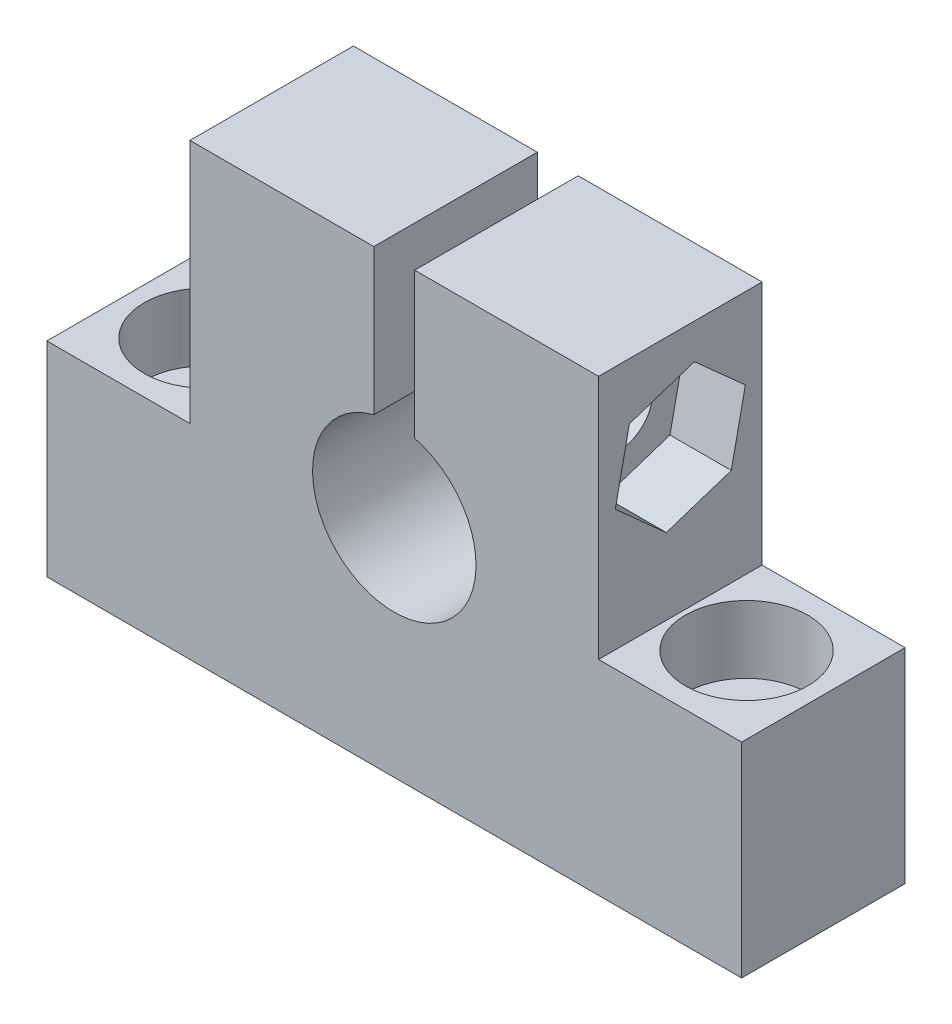
ISO-10303-21;
HEADER;
FILE_DESCRIPTION(('STEP AP214'),'2;1');
FILE_NAME('part.step','',(''),(''),'','','');
FILE_SCHEMA(('AUTOMOTIVE_DESIGN { 1 0 10303 214 1 1 1 1 }'));
ENDSEC;
DATA;
#1=APPLICATION_CONTEXT('core data for automotive mechanical design processes');
#2=APPLICATION_PROTOCOL_DEFINITION('international standard','automotive_design',2000,#1);
#3=PRODUCT_CONTEXT('',#1,'mechanical');
#4=PRODUCT('Part','Part','',(#3));
#5=PRODUCT_RELATED_PRODUCT_CATEGORY('part','',(#4));
#6=PRODUCT_DEFINITION_FORMATION('','',#4);
#7=PRODUCT_DEFINITION_CONTEXT('part definition',#1,'design');
#8=PRODUCT_DEFINITION('design','',#6,#7);
#9=PRODUCT_DEFINITION_SHAPE('','',#8);
#10=(LENGTH_UNIT() NAMED_UNIT(*) SI_UNIT(.MILLI.,.METRE.));
#11=(NAMED_UNIT(*) PLANE_ANGLE_UNIT() SI_UNIT($,.RADIAN.));
#12=(NAMED_UNIT(*) SI_UNIT($,.STERADIAN.) SOLID_ANGLE_UNIT());
#13=UNCERTAINTY_MEASURE_WITH_UNIT(LENGTH_MEASURE(1.E-05),#10,'distance_accuracy_value','');
#14=(GEOMETRIC_REPRESENTATION_CONTEXT(3) GLOBAL_UNCERTAINTY_ASSIGNED_CONTEXT((#13)) GLOBAL_UNIT_ASSIGNED_CONTEXT((#10,
#11,#12)) REPRESENTATION_CONTEXT('',''));
#15=CARTESIAN_POINT('',(0.,0.,0.));
#16=DIRECTION('',(0.,0.,1.));
#17=DIRECTION('',(1.,0.,0.));
#18=AXIS2_PLACEMENT_3D('',#15,#16,#17);
#19=CARTESIAN_POINT('',(13.2396132723695,0.,4.));
#20=DIRECTION('',(0.,1.,0.));
#21=DIRECTION('',(-1.,0.,0.));
#22=AXIS2_PLACEMENT_3D('',#19,#20,#21);
#23=CYLINDRICAL_SURFACE('',#22,1.65);
#24=CARTESIAN_POINT('',(13.2396132723695,0.,4.));
#25=DIRECTION('',(0.,1.,0.));
#26=DIRECTION('',(1.,0.,0.));
#27=AXIS2_PLACEMENT_3D('',#24,#25,#26);
#28=CIRCLE('',#27,1.65);
#29=CARTESIAN_POINT('',(14.8896132723695,0.,4.));
#30=VERTEX_POINT('',#29);
#31=EDGE_CURVE('E189',#30,#30,#28,.T.);
#32=ORIENTED_EDGE('',*,*,#31,.F.);
#33=EDGE_LOOP('',(#32));
#34=FACE_BOUND('',#33,.T.);
#35=CARTESIAN_POINT('',(13.2396132723695,6.69999999999999,4.));
#36=DIRECTION('',(0.,1.,0.));
#37=DIRECTION('',(-1.,0.,0.));
#38=AXIS2_PLACEMENT_3D('',#35,#36,#37);
#39=CIRCLE('',#38,1.65);
#40=CARTESIAN_POINT('',(11.5896132723695,6.69999999999999,4.));
#41=VERTEX_POINT('',#40);
#42=EDGE_CURVE('E38',#41,#41,#39,.F.);
#43=ORIENTED_EDGE('',*,*,#42,.F.);
#44=EDGE_LOOP('',(#43));
#45=FACE_BOUND('',#44,.T.);
#46=ADVANCED_FACE('F34',(#34,#45),#23,.F.);
#47=CARTESIAN_POINT('',(-13.2396132723695,0.,4.));
#48=DIRECTION('',(0.,1.,0.));
#49=DIRECTION('',(-1.,0.,0.));
#50=AXIS2_PLACEMENT_3D('',#47,#48,#49);
#51=CYLINDRICAL_SURFACE('',#50,1.65);
#52=CARTESIAN_POINT('',(-13.2396132723695,0.,4.));
#53=DIRECTION('',(0.,1.,0.));
#54=DIRECTION('',(-1.,0.,0.));
#55=AXIS2_PLACEMENT_3D('',#52,#53,#54);
#56=CIRCLE('',#55,1.65);
#57=CARTESIAN_POINT('',(-14.8896132723695,0.,4.));
#58=VERTEX_POINT('',#57);
#59=EDGE_CURVE('E201',#58,#58,#56,.T.);
#60=ORIENTED_EDGE('',*,*,#59,.F.);
#61=EDGE_LOOP('',(#60));
#62=FACE_BOUND('',#61,.T.);
#63=CARTESIAN_POINT('',(-13.2396132723695,6.7,4.));
#64=DIRECTION('',(0.,1.,0.));
#65=DIRECTION('',(-1.,0.,0.));
#66=AXIS2_PLACEMENT_3D('',#63,#64,#65);
#67=CIRCLE('',#66,1.65);
#68=CARTESIAN_POINT('',(-14.8896132723695,6.7,4.));
#69=VERTEX_POINT('',#68);
#70=EDGE_CURVE('E319',#69,#69,#67,.F.);
#71=ORIENTED_EDGE('',*,*,#70,.F.);
#72=EDGE_LOOP('',(#71));
#73=FACE_BOUND('',#72,.T.);
#74=ADVANCED_FACE('F349',(#62,#73),#51,.F.);
#75=CARTESIAN_POINT('',(17.,17.,4.));
#76=DIRECTION('',(-1.,0.,0.));
#77=DIRECTION('',(0.,-1.,0.));
#78=AXIS2_PLACEMENT_3D('',#75,#76,#77);
#79=CYLINDRICAL_SURFACE('',#78,1.65);
#80=CARTESIAN_POINT('',(1.,17.,4.));
#81=DIRECTION('',(1.,0.,0.));
#82=DIRECTION('',(0.,1.,0.));
#83=AXIS2_PLACEMENT_3D('',#80,#81,#82);
#84=CIRCLE('',#83,1.65);
#85=CARTESIAN_POINT('',(1.,18.65,4.));
#86=VERTEX_POINT('',#85);
#87=EDGE_CURVE('E228',#86,#86,#84,.T.);
#88=ORIENTED_EDGE('',*,*,#87,.F.);
#89=EDGE_LOOP('',(#88));
#90=FACE_BOUND('',#89,.T.);
#91=CARTESIAN_POINT('',(7.,17.,4.));
#92=DIRECTION('',(1.,0.,0.));
#93=DIRECTION('',(0.,1.,0.));
#94=AXIS2_PLACEMENT_3D('',#91,#92,#93);
#95=CIRCLE('',#94,1.65);
#96=CARTESIAN_POINT('',(7.,18.65,4.));
#97=VERTEX_POINT('',#96);
#98=EDGE_CURVE('E213',#97,#97,#95,.F.);
#99=ORIENTED_EDGE('',*,*,#98,.F.);
#100=EDGE_LOOP('',(#99));
#101=FACE_BOUND('',#100,.T.);
#102=ADVANCED_FACE('F372',(#90,#101),#79,.F.);
#103=CARTESIAN_POINT('',(-1.,17.,4.));
#104=DIRECTION('',(-1.,0.,0.));
#105=DIRECTION('',(0.,-1.,0.));
#106=AXIS2_PLACEMENT_3D('',#103,#104,#105);
#107=CIRCLE('',#106,1.65);
#108=CARTESIAN_POINT('',(-1.,15.35,4.));
#109=VERTEX_POINT('',#108);
#110=EDGE_CURVE('E232',#109,#109,#107,.T.);
#111=ORIENTED_EDGE('',*,*,#110,.F.);
#112=EDGE_LOOP('',(#111));
#113=FACE_BOUND('',#112,.T.);
#114=CARTESIAN_POINT('',(-6.7,17.,4.));
#115=DIRECTION('',(-1.,0.,0.));
#116=DIRECTION('',(0.,-1.,0.));
#117=AXIS2_PLACEMENT_3D('',#114,#115,#116);
#118=CIRCLE('',#117,1.65);
#119=CARTESIAN_POINT('',(-6.7,15.35,4.));
#120=VERTEX_POINT('',#119);
#121=EDGE_CURVE('E224',#120,#120,#118,.F.);
#122=ORIENTED_EDGE('',*,*,#121,.F.);
#123=EDGE_LOOP('',(#122));
#124=FACE_BOUND('',#123,.T.);
#125=ADVANCED_FACE('F408',(#113,#124),#79,.F.);
#126=CARTESIAN_POINT('',(-10.,22.,8.));
#127=DIRECTION('',(0.,-1.,0.));
#128=DIRECTION('',(0.,0.,-1.));
#129=AXIS2_PLACEMENT_3D('',#126,#127,#128);
#130=PLANE('',#129);
#131=DIRECTION('',(-1.,0.,0.));
#132=VECTOR('',#131,1.);
#133=CARTESIAN_POINT('',(-10.,22.,0.));
#134=LINE('',#133,#132);
#135=CARTESIAN_POINT('',(10.,22.,0.));
#136=VERTEX_POINT('',#135);
#137=CARTESIAN_POINT('',(1.,22.,0.));
#138=VERTEX_POINT('',#137);
#139=EDGE_CURVE('E281',#136,#138,#134,.T.);
#140=ORIENTED_EDGE('',*,*,#139,.T.);
#141=DIRECTION('',(0.,0.,1.));
#142=VECTOR('',#141,1.);
#143=CARTESIAN_POINT('',(1.,22.,0.));
#144=LINE('',#143,#142);
#145=CARTESIAN_POINT('',(1.,22.,8.));
#146=VERTEX_POINT('',#145);
#147=EDGE_CURVE('E241',#138,#146,#144,.T.);
#148=ORIENTED_EDGE('',*,*,#147,.T.);
#149=DIRECTION('',(-1.,0.,0.));
#150=VECTOR('',#149,1.);
#151=CARTESIAN_POINT('',(-10.,22.,8.));
#152=LINE('',#151,#150);
#153=CARTESIAN_POINT('',(10.,22.,8.));
#154=VERTEX_POINT('',#153);
#155=EDGE_CURVE('E262',#154,#146,#152,.T.);
#156=ORIENTED_EDGE('',*,*,#155,.F.);
#157=DIRECTION('',(0.,0.,-1.));
#158=VECTOR('',#157,1.);
#159=CARTESIAN_POINT('',(10.,22.,8.));
#160=LINE('',#159,#158);
#161=EDGE_CURVE('E11',#154,#136,#160,.T.);
#162=ORIENTED_EDGE('',*,*,#161,.T.);
#163=EDGE_LOOP('',(#140,#148,#156,#162));
#164=FACE_BOUND('',#163,.T.);
#165=ADVANCED_FACE('F452',(#164),#130,.F.);
#166=CARTESIAN_POINT('',(10.,22.,8.));
#167=DIRECTION('',(-1.,0.,0.));
#168=DIRECTION('',(0.,-1.,0.));
#169=AXIS2_PLACEMENT_3D('',#166,#167,#168);
#170=PLANE('',#169);
#171=DIRECTION('',(0.,-0.978664212669979,0.205466198775006));
#172=VECTOR('',#171,1.);
#173=CARTESIAN_POINT('',(10.,19.2344449116782,6.4941109177438));
#174=LINE('',#173,#172);
#175=CARTESIAN_POINT('',(10.,19.2344449116782,6.4941109177438));
#176=VERTEX_POINT('',#175);
#177=CARTESIAN_POINT('',(10.,15.9572590412169,7.18214151574208));
#178=VERTEX_POINT('',#177);
#179=EDGE_CURVE('E200',#176,#178,#174,.T.);
#180=ORIENTED_EDGE('',*,*,#179,.F.);
#181=DIRECTION('',(0.,-0.31139315857681,0.950281169334401));
#182=VECTOR('',#181,1.);
#183=CARTESIAN_POINT('',(10.,20.2771858704613,3.31196940200171));
#184=LINE('',#183,#182);
#185=CARTESIAN_POINT('',(10.,20.2771858704613,3.31196940200171));
#186=VERTEX_POINT('',#185);
#187=EDGE_CURVE('E51',#186,#176,#184,.T.);
#188=ORIENTED_EDGE('',*,*,#187,.F.);
#189=DIRECTION('',(0.,0.667271054093169,0.744814970559394));
#190=VECTOR('',#189,1.);
#191=CARTESIAN_POINT('',(10.,18.0427409587831,0.817858484257921));
#192=LINE('',#191,#190);
#193=CARTESIAN_POINT('',(10.,18.0427409587831,0.817858484257921));
#194=VERTEX_POINT('',#193);
#195=EDGE_CURVE('E183',#194,#186,#192,.T.);
#196=ORIENTED_EDGE('',*,*,#195,.F.);
#197=DIRECTION('',(0.,0.978664212669978,-0.205466198775008));
#198=VECTOR('',#197,1.);
#199=CARTESIAN_POINT('',(10.,14.7655550883218,1.50588908225622));
#200=LINE('',#199,#198);
#201=CARTESIAN_POINT('',(10.,14.7655550883218,1.50588908225622));
#202=VERTEX_POINT('',#201);
#203=EDGE_CURVE('E186',#202,#194,#200,.T.);
#204=ORIENTED_EDGE('',*,*,#203,.F.);
#205=DIRECTION('',(0.,0.31139315857681,-0.950281169334401));
#206=VECTOR('',#205,1.);
#207=CARTESIAN_POINT('',(10.,13.7228141295387,4.68803059799829));
#208=LINE('',#207,#206);
#209=CARTESIAN_POINT('',(10.,13.7228141295387,4.68803059799829));
#210=VERTEX_POINT('',#209);
#211=EDGE_CURVE('E206',#210,#202,#208,.T.);
#212=ORIENTED_EDGE('',*,*,#211,.F.);
#213=DIRECTION('',(0.,-0.667271054093169,-0.744814970559394));
#214=VECTOR('',#213,1.);
#215=CARTESIAN_POINT('',(10.,15.9572590412169,7.18214151574208));
#216=LINE('',#215,#214);
#217=EDGE_CURVE('E203',#178,#210,#216,.T.);
#218=ORIENTED_EDGE('',*,*,#217,.F.);
#219=EDGE_LOOP('',(#180,#188,#196,#204,#212,#218));
#220=FACE_BOUND('',#219,.T.);
#221=DIRECTION('',(0.,1.,0.));
#222=VECTOR('',#221,1.);
#223=CARTESIAN_POINT('',(10.,22.,0.));
#224=LINE('',#223,#222);
#225=CARTESIAN_POINT('',(10.,10.,0.));
#226=VERTEX_POINT('',#225);
#227=EDGE_CURVE('E250',#226,#136,#224,.T.);
#228=ORIENTED_EDGE('',*,*,#227,.T.);
#229=ORIENTED_EDGE('',*,*,#161,.F.);
#230=DIRECTION('',(0.,1.,0.));
#231=VECTOR('',#230,1.);
#232=CARTESIAN_POINT('',(10.,22.,8.));
#233=LINE('',#232,#231);
#234=CARTESIAN_POINT('',(10.,10.,8.));
#235=VERTEX_POINT('',#234);
#236=EDGE_CURVE('E257',#235,#154,#233,.T.);
#237=ORIENTED_EDGE('',*,*,#236,.F.);
#238=DIRECTION('',(0.,0.,-1.));
#239=VECTOR('',#238,1.);
#240=CARTESIAN_POINT('',(10.,10.,8.));
#241=LINE('',#240,#239);
#242=EDGE_CURVE('E277',#235,#226,#241,.T.);
#243=ORIENTED_EDGE('',*,*,#242,.T.);
#244=EDGE_LOOP('',(#228,#229,#237,#243));
#245=FACE_BOUND('',#244,.T.);
#246=ADVANCED_FACE('F36',(#220,#245),#170,.F.);
#247=CARTESIAN_POINT('',(-1.,22.,8.));
#248=VERTEX_POINT('',#247);
#249=CARTESIAN_POINT('',(-10.,22.,8.));
#250=VERTEX_POINT('',#249);
#251=EDGE_CURVE('E260',#248,#250,#152,.T.);
#252=ORIENTED_EDGE('',*,*,#251,.F.);
#253=DIRECTION('',(0.,0.,1.));
#254=VECTOR('',#253,1.);
#255=CARTESIAN_POINT('',(-1.,22.,0.));
#256=LINE('',#255,#254);
#257=CARTESIAN_POINT('',(-1.,22.,0.));
#258=VERTEX_POINT('',#257);
#259=EDGE_CURVE('E253',#258,#248,#256,.T.);
#260=ORIENTED_EDGE('',*,*,#259,.F.);
#261=CARTESIAN_POINT('',(-10.,22.,0.));
#262=VERTEX_POINT('',#261);
#263=EDGE_CURVE('E280',#258,#262,#134,.T.);
#264=ORIENTED_EDGE('',*,*,#263,.T.);
#265=DIRECTION('',(0.,0.,-1.));
#266=VECTOR('',#265,1.);
#267=CARTESIAN_POINT('',(-10.,22.,8.));
#268=LINE('',#267,#266);
#269=EDGE_CURVE('E43',#250,#262,#268,.T.);
#270=ORIENTED_EDGE('',*,*,#269,.F.);
#271=EDGE_LOOP('',(#252,#260,#264,#270));
#272=FACE_BOUND('',#271,.T.);
#273=ADVANCED_FACE('F448',(#272),#130,.F.);
#274=CARTESIAN_POINT('',(-10.,22.,8.));
#275=DIRECTION('',(1.,0.,0.));
#276=DIRECTION('',(0.,1.,0.));
#277=AXIS2_PLACEMENT_3D('',#274,#275,#276);
#278=PLANE('',#277);
#279=CARTESIAN_POINT('',(-10.,17.,4.));
#280=DIRECTION('',(-1.,0.,0.));
#281=DIRECTION('',(0.,-1.,0.));
#282=AXIS2_PLACEMENT_3D('',#279,#280,#281);
#283=CIRCLE('',#282,3.);
#284=CARTESIAN_POINT('',(-10.,14.,4.));
#285=VERTEX_POINT('',#284);
#286=EDGE_CURVE('E225',#285,#285,#283,.T.);
#287=ORIENTED_EDGE('',*,*,#286,.F.);
#288=EDGE_LOOP('',(#287));
#289=FACE_BOUND('',#288,.T.);
#290=DIRECTION('',(0.,-1.,0.));
#291=VECTOR('',#290,1.);
#292=CARTESIAN_POINT('',(-10.,22.,0.));
#293=LINE('',#292,#291);
#294=CARTESIAN_POINT('',(-10.,10.,0.));
#295=VERTEX_POINT('',#294);
#296=EDGE_CURVE('E284',#262,#295,#293,.T.);
#297=ORIENTED_EDGE('',*,*,#296,.T.);
#298=DIRECTION('',(0.,0.,-1.));
#299=VECTOR('',#298,1.);
#300=CARTESIAN_POINT('',(-10.,10.,8.));
#301=LINE('',#300,#299);
#302=CARTESIAN_POINT('',(-10.,10.,8.));
#303=VERTEX_POINT('',#302);
#304=EDGE_CURVE('E309',#303,#295,#301,.T.);
#305=ORIENTED_EDGE('',*,*,#304,.F.);
#306=DIRECTION('',(0.,-1.,0.));
#307=VECTOR('',#306,1.);
#308=CARTESIAN_POINT('',(-10.,22.,8.));
#309=LINE('',#308,#307);
#310=EDGE_CURVE('E265',#250,#303,#309,.T.);
#311=ORIENTED_EDGE('',*,*,#310,.F.);
#312=ORIENTED_EDGE('',*,*,#269,.T.);
#313=EDGE_LOOP('',(#297,#305,#311,#312));
#314=FACE_BOUND('',#313,.T.);
#315=ADVANCED_FACE('F445',(#289,#314),#278,.F.);
#316=CARTESIAN_POINT('',(-10.,10.,8.));
#317=DIRECTION('',(0.,-1.,0.));
#318=DIRECTION('',(1.,0.,0.));
#319=AXIS2_PLACEMENT_3D('',#316,#317,#318);
#320=PLANE('',#319);
#321=CARTESIAN_POINT('',(-13.2396132723695,10.,4.));
#322=DIRECTION('',(0.,1.,0.));
#323=DIRECTION('',(-1.,0.,0.));
#324=AXIS2_PLACEMENT_3D('',#321,#322,#323);
#325=CIRCLE('',#324,3.);
#326=CARTESIAN_POINT('',(-16.2396132723695,10.,4.));
#327=VERTEX_POINT('',#326);
#328=EDGE_CURVE('E336',#327,#327,#325,.T.);
#329=ORIENTED_EDGE('',*,*,#328,.F.);
#330=EDGE_LOOP('',(#329));
#331=FACE_BOUND('',#330,.T.);
#332=DIRECTION('',(-1.,0.,0.));
#333=VECTOR('',#332,1.);
#334=CARTESIAN_POINT('',(-10.,10.,0.));
#335=LINE('',#334,#333);
#336=CARTESIAN_POINT('',(-17.,9.99999999999999,0.));
#337=VERTEX_POINT('',#336);
#338=EDGE_CURVE('E286',#295,#337,#335,.T.);
#339=ORIENTED_EDGE('',*,*,#338,.T.);
#340=DIRECTION('',(0.,0.,-1.));
#341=VECTOR('',#340,1.);
#342=CARTESIAN_POINT('',(-17.,9.99999999999999,8.));
#343=LINE('',#342,#341);
#344=CARTESIAN_POINT('',(-17.,9.99999999999999,8.));
#345=VERTEX_POINT('',#344);
#346=EDGE_CURVE('E306',#345,#337,#343,.T.);
#347=ORIENTED_EDGE('',*,*,#346,.F.);
#348=DIRECTION('',(-1.,0.,0.));
#349=VECTOR('',#348,1.);
#350=CARTESIAN_POINT('',(-10.,10.,8.));
#351=LINE('',#350,#349);
#352=EDGE_CURVE('E267',#303,#345,#351,.T.);
#353=ORIENTED_EDGE('',*,*,#352,.F.);
#354=ORIENTED_EDGE('',*,*,#304,.T.);
#355=EDGE_LOOP('',(#339,#347,#353,#354));
#356=FACE_BOUND('',#355,.T.);
#357=ADVANCED_FACE('F441',(#331,#356),#320,.F.);
#358=CARTESIAN_POINT('',(-17.,9.99999999999999,8.));
#359=DIRECTION('',(1.,0.,0.));
#360=DIRECTION('',(0.,0.,-1.));
#361=AXIS2_PLACEMENT_3D('',#358,#359,#360);
#362=PLANE('',#361);
#363=DIRECTION('',(0.,-1.,0.));
#364=VECTOR('',#363,1.);
#365=CARTESIAN_POINT('',(-17.,9.99999999999999,0.));
#366=LINE('',#365,#364);
#367=CARTESIAN_POINT('',(-17.,0.,0.));
#368=VERTEX_POINT('',#367);
#369=EDGE_CURVE('E288',#337,#368,#366,.T.);
#370=ORIENTED_EDGE('',*,*,#369,.T.);
#371=DIRECTION('',(0.,0.,-1.));
#372=VECTOR('',#371,1.);
#373=CARTESIAN_POINT('',(-17.,0.,8.));
#374=LINE('',#373,#372);
#375=CARTESIAN_POINT('',(-17.,0.,8.));
#376=VERTEX_POINT('',#375);
#377=EDGE_CURVE('E303',#376,#368,#374,.T.);
#378=ORIENTED_EDGE('',*,*,#377,.F.);
#379=DIRECTION('',(0.,-1.,0.));
#380=VECTOR('',#379,1.);
#381=CARTESIAN_POINT('',(-17.,9.99999999999999,8.));
#382=LINE('',#381,#380);
#383=EDGE_CURVE('E269',#345,#376,#382,.T.);
#384=ORIENTED_EDGE('',*,*,#383,.F.);
#385=ORIENTED_EDGE('',*,*,#346,.T.);
#386=EDGE_LOOP('',(#370,#378,#384,#385));
#387=FACE_BOUND('',#386,.T.);
#388=ADVANCED_FACE('F438',(#387),#362,.F.);
#389=CARTESIAN_POINT('',(17.,0.,8.));
#390=DIRECTION('',(0.,1.,0.));
#391=DIRECTION('',(0.,0.,1.));
#392=AXIS2_PLACEMENT_3D('',#389,#390,#391);
#393=PLANE('',#392);
#394=ORIENTED_EDGE('',*,*,#59,.T.);
#395=EDGE_LOOP('',(#394));
#396=FACE_BOUND('',#395,.T.);
#397=ORIENTED_EDGE('',*,*,#31,.T.);
#398=EDGE_LOOP('',(#397));
#399=FACE_BOUND('',#398,.T.);
#400=DIRECTION('',(1.,0.,0.));
#401=VECTOR('',#400,1.);
#402=CARTESIAN_POINT('',(17.,0.,0.));
#403=LINE('',#402,#401);
#404=CARTESIAN_POINT('',(17.,0.,0.));
#405=VERTEX_POINT('',#404);
#406=EDGE_CURVE('E290',#368,#405,#403,.T.);
#407=ORIENTED_EDGE('',*,*,#406,.T.);
#408=DIRECTION('',(0.,0.,-1.));
#409=VECTOR('',#408,1.);
#410=CARTESIAN_POINT('',(17.,0.,8.));
#411=LINE('',#410,#409);
#412=CARTESIAN_POINT('',(17.,0.,8.));
#413=VERTEX_POINT('',#412);
#414=EDGE_CURVE('E300',#413,#405,#411,.T.);
#415=ORIENTED_EDGE('',*,*,#414,.F.);
#416=DIRECTION('',(1.,0.,0.));
#417=VECTOR('',#416,1.);
#418=CARTESIAN_POINT('',(17.,0.,8.));
#419=LINE('',#418,#417);
#420=EDGE_CURVE('E271',#376,#413,#419,.T.);
#421=ORIENTED_EDGE('',*,*,#420,.F.);
#422=ORIENTED_EDGE('',*,*,#377,.T.);
#423=EDGE_LOOP('',(#407,#415,#421,#422));
#424=FACE_BOUND('',#423,.T.);
#425=ADVANCED_FACE('F344',(#396,#399,#424),#393,.F.);
#426=CARTESIAN_POINT('',(17.,9.99999999999999,8.));
#427=DIRECTION('',(-1.,0.,0.));
#428=DIRECTION('',(0.,0.,1.));
#429=AXIS2_PLACEMENT_3D('',#426,#427,#428);
#430=PLANE('',#429);
#431=DIRECTION('',(0.,1.,0.));
#432=VECTOR('',#431,1.);
#433=CARTESIAN_POINT('',(17.,9.99999999999999,0.));
#434=LINE('',#433,#432);
#435=CARTESIAN_POINT('',(17.,9.99999999999999,0.));
#436=VERTEX_POINT('',#435);
#437=EDGE_CURVE('E292',#405,#436,#434,.T.);
#438=ORIENTED_EDGE('',*,*,#437,.T.);
#439=DIRECTION('',(0.,0.,-1.));
#440=VECTOR('',#439,1.);
#441=CARTESIAN_POINT('',(17.,9.99999999999999,8.));
#442=LINE('',#441,#440);
#443=CARTESIAN_POINT('',(17.,9.99999999999999,8.));
#444=VERTEX_POINT('',#443);
#445=EDGE_CURVE('E297',#444,#436,#442,.T.);
#446=ORIENTED_EDGE('',*,*,#445,.F.);
#447=DIRECTION('',(0.,1.,0.));
#448=VECTOR('',#447,1.);
#449=CARTESIAN_POINT('',(17.,9.99999999999999,8.));
#450=LINE('',#449,#448);
#451=EDGE_CURVE('E273',#413,#444,#450,.T.);
#452=ORIENTED_EDGE('',*,*,#451,.F.);
#453=ORIENTED_EDGE('',*,*,#414,.T.);
#454=EDGE_LOOP('',(#438,#446,#452,#453));
#455=FACE_BOUND('',#454,.T.);
#456=ADVANCED_FACE('F431',(#455),#430,.F.);
#457=CARTESIAN_POINT('',(10.,10.,8.));
#458=DIRECTION('',(0.,-1.,0.));
#459=DIRECTION('',(1.,0.,0.));
#460=AXIS2_PLACEMENT_3D('',#457,#458,#459);
#461=PLANE('',#460);
#462=CARTESIAN_POINT('',(13.2396132723695,9.99999999999999,4.));
#463=DIRECTION('',(0.,1.,0.));
#464=DIRECTION('',(-1.,0.,0.));
#465=AXIS2_PLACEMENT_3D('',#462,#463,#464);
#466=CIRCLE('',#465,3.);
#467=CARTESIAN_POINT('',(10.2396132723695,9.99999999999999,4.));
#468=VERTEX_POINT('',#467);
#469=EDGE_CURVE('E326',#468,#468,#466,.T.);
#470=ORIENTED_EDGE('',*,*,#469,.F.);
#471=EDGE_LOOP('',(#470));
#472=FACE_BOUND('',#471,.T.);
#473=DIRECTION('',(-1.,0.,0.));
#474=VECTOR('',#473,1.);
#475=CARTESIAN_POINT('',(10.,10.,0.));
#476=LINE('',#475,#474);
#477=EDGE_CURVE('E261',#436,#226,#476,.T.);
#478=ORIENTED_EDGE('',*,*,#477,.T.);
#479=ORIENTED_EDGE('',*,*,#242,.F.);
#480=DIRECTION('',(-1.,0.,0.));
#481=VECTOR('',#480,1.);
#482=CARTESIAN_POINT('',(10.,10.,8.));
#483=LINE('',#482,#481);
#484=EDGE_CURVE('E275',#444,#235,#483,.T.);
#485=ORIENTED_EDGE('',*,*,#484,.F.);
#486=ORIENTED_EDGE('',*,*,#445,.T.);
#487=EDGE_LOOP('',(#478,#479,#485,#486));
#488=FACE_BOUND('',#487,.T.);
#489=ADVANCED_FACE('F424',(#472,#488),#461,.F.);
#490=CARTESIAN_POINT('',(0.,0.,8.));
#491=DIRECTION('',(0.,0.,1.));
#492=DIRECTION('',(1.,0.,0.));
#493=AXIS2_PLACEMENT_3D('',#490,#491,#492);
#494=PLANE('',#493);
#495=DIRECTION('',(0.,1.,0.));
#496=VECTOR('',#495,1.);
#497=CARTESIAN_POINT('',(1.,22.,8.));
#498=LINE('',#497,#496);
#499=CARTESIAN_POINT('',(0.999999999999997,14.8729833462074,8.));
#500=VERTEX_POINT('',#499);
#501=EDGE_CURVE('E231',#500,#146,#498,.T.);
#502=ORIENTED_EDGE('',*,*,#501,.F.);
#503=CARTESIAN_POINT('',(0.,11.,8.));
#504=DIRECTION('',(0.,0.,1.));
#505=DIRECTION('',(1.,0.,0.));
#506=AXIS2_PLACEMENT_3D('',#503,#504,#505);
#507=CIRCLE('',#506,4.);
#508=CARTESIAN_POINT('',(-0.999999999999999,14.8729833462074,8.));
#509=VERTEX_POINT('',#508);
#510=EDGE_CURVE('E237',#509,#500,#507,.T.);
#511=ORIENTED_EDGE('',*,*,#510,.F.);
#512=DIRECTION('',(0.,-1.,0.));
#513=VECTOR('',#512,1.);
#514=CARTESIAN_POINT('',(-1.,22.,8.));
#515=LINE('',#514,#513);
#516=EDGE_CURVE('E243',#248,#509,#515,.T.);
#517=ORIENTED_EDGE('',*,*,#516,.F.);
#518=ORIENTED_EDGE('',*,*,#251,.T.);
#519=ORIENTED_EDGE('',*,*,#310,.T.);
#520=ORIENTED_EDGE('',*,*,#352,.T.);
#521=ORIENTED_EDGE('',*,*,#383,.T.);
#522=ORIENTED_EDGE('',*,*,#420,.T.);
#523=ORIENTED_EDGE('',*,*,#451,.T.);
#524=ORIENTED_EDGE('',*,*,#484,.T.);
#525=ORIENTED_EDGE('',*,*,#236,.T.);
#526=ORIENTED_EDGE('',*,*,#155,.T.);
#527=EDGE_LOOP('',(#502,#511,#517,#518,#519,#520,#521,#522,#523,#524,#525,#526));
#528=FACE_BOUND('',#527,.T.);
#529=ADVANCED_FACE('F421',(#528),#494,.T.);
#530=CARTESIAN_POINT('',(0.,0.,0.));
#531=DIRECTION('',(0.,0.,1.));
#532=DIRECTION('',(1.,0.,0.));
#533=AXIS2_PLACEMENT_3D('',#530,#531,#532);
#534=PLANE('',#533);
#535=CARTESIAN_POINT('',(0.,11.,0.));
#536=DIRECTION('',(0.,0.,1.));
#537=DIRECTION('',(1.,0.,0.));
#538=AXIS2_PLACEMENT_3D('',#535,#536,#537);
#539=CIRCLE('',#538,4.);
#540=CARTESIAN_POINT('',(-0.999999999999999,14.8729833462074,0.));
#541=VERTEX_POINT('',#540);
#542=CARTESIAN_POINT('',(0.999999999999997,14.8729833462074,0.));
#543=VERTEX_POINT('',#542);
#544=EDGE_CURVE('E59',#541,#543,#539,.T.);
#545=ORIENTED_EDGE('',*,*,#544,.T.);
#546=DIRECTION('',(0.,1.,0.));
#547=VECTOR('',#546,1.);
#548=CARTESIAN_POINT('',(1.,22.,0.));
#549=LINE('',#548,#547);
#550=EDGE_CURVE('E233',#543,#138,#549,.T.);
#551=ORIENTED_EDGE('',*,*,#550,.T.);
#552=ORIENTED_EDGE('',*,*,#139,.F.);
#553=ORIENTED_EDGE('',*,*,#227,.F.);
#554=ORIENTED_EDGE('',*,*,#477,.F.);
#555=ORIENTED_EDGE('',*,*,#437,.F.);
#556=ORIENTED_EDGE('',*,*,#406,.F.);
#557=ORIENTED_EDGE('',*,*,#369,.F.);
#558=ORIENTED_EDGE('',*,*,#338,.F.);
#559=ORIENTED_EDGE('',*,*,#296,.F.);
#560=ORIENTED_EDGE('',*,*,#263,.F.);
#561=DIRECTION('',(0.,-1.,0.));
#562=VECTOR('',#561,1.);
#563=CARTESIAN_POINT('',(-1.,22.,0.));
#564=LINE('',#563,#562);
#565=EDGE_CURVE('E236',#258,#541,#564,.T.);
#566=ORIENTED_EDGE('',*,*,#565,.T.);
#567=EDGE_LOOP('',(#545,#551,#552,#553,#554,#555,#556,#557,#558,#559,#560,#566));
#568=FACE_BOUND('',#567,.T.);
#569=ADVANCED_FACE('F419',(#568),#534,.F.);
#570=CARTESIAN_POINT('',(1.,22.,0.));
#571=DIRECTION('',(1.,0.,0.));
#572=DIRECTION('',(0.,1.,0.));
#573=AXIS2_PLACEMENT_3D('',#570,#571,#572);
#574=PLANE('',#573);
#575=ORIENTED_EDGE('',*,*,#87,.T.);
#576=EDGE_LOOP('',(#575));
#577=FACE_BOUND('',#576,.T.);
#578=ORIENTED_EDGE('',*,*,#501,.T.);
#579=ORIENTED_EDGE('',*,*,#147,.F.);
#580=ORIENTED_EDGE('',*,*,#550,.F.);
#581=DIRECTION('',(0.,0.,1.));
#582=VECTOR('',#581,1.);
#583=CARTESIAN_POINT('',(0.999999999999997,14.8729833462074,0.));
#584=LINE('',#583,#582);
#585=EDGE_CURVE('E248',#543,#500,#584,.T.);
#586=ORIENTED_EDGE('',*,*,#585,.T.);
#587=EDGE_LOOP('',(#578,#579,#580,#586));
#588=FACE_BOUND('',#587,.T.);
#589=ADVANCED_FACE('F413',(#577,#588),#574,.F.);
#590=CARTESIAN_POINT('',(0.,11.,0.));
#591=DIRECTION('',(0.,0.,1.));
#592=DIRECTION('',(1.,0.,0.));
#593=AXIS2_PLACEMENT_3D('',#590,#591,#592);
#594=CYLINDRICAL_SURFACE('',#593,4.);
#595=ORIENTED_EDGE('',*,*,#510,.T.);
#596=ORIENTED_EDGE('',*,*,#585,.F.);
#597=ORIENTED_EDGE('',*,*,#544,.F.);
#598=DIRECTION('',(0.,0.,1.));
#599=VECTOR('',#598,1.);
#600=CARTESIAN_POINT('',(-0.999999999999999,14.8729833462074,0.));
#601=LINE('',#600,#599);
#602=EDGE_CURVE('E251',#541,#509,#601,.T.);
#603=ORIENTED_EDGE('',*,*,#602,.T.);
#604=EDGE_LOOP('',(#595,#596,#597,#603));
#605=FACE_BOUND('',#604,.T.);
#606=ADVANCED_FACE('F410',(#605),#594,.F.);
#607=CARTESIAN_POINT('',(-1.,22.,0.));
#608=DIRECTION('',(-1.,0.,0.));
#609=DIRECTION('',(0.,-1.,0.));
#610=AXIS2_PLACEMENT_3D('',#607,#608,#609);
#611=PLANE('',#610);
#612=ORIENTED_EDGE('',*,*,#110,.T.);
#613=EDGE_LOOP('',(#612));
#614=FACE_BOUND('',#613,.T.);
#615=ORIENTED_EDGE('',*,*,#516,.T.);
#616=ORIENTED_EDGE('',*,*,#602,.F.);
#617=ORIENTED_EDGE('',*,*,#565,.F.);
#618=ORIENTED_EDGE('',*,*,#259,.T.);
#619=EDGE_LOOP('',(#615,#616,#617,#618));
#620=FACE_BOUND('',#619,.T.);
#621=ADVANCED_FACE('F401',(#614,#620),#611,.F.);
#622=CARTESIAN_POINT('',(-6.7,17.,4.));
#623=DIRECTION('',(-1.,0.,0.));
#624=DIRECTION('',(0.,-1.,0.));
#625=AXIS2_PLACEMENT_3D('',#622,#623,#624);
#626=PLANE('',#625);
#627=CARTESIAN_POINT('',(-6.7,17.,4.));
#628=DIRECTION('',(-1.,0.,0.));
#629=DIRECTION('',(0.,-1.,0.));
#630=AXIS2_PLACEMENT_3D('',#627,#628,#629);
#631=CIRCLE('',#630,3.);
#632=CARTESIAN_POINT('',(-6.7,14.,4.));
#633=VERTEX_POINT('',#632);
#634=EDGE_CURVE('E221',#633,#633,#631,.T.);
#635=ORIENTED_EDGE('',*,*,#634,.T.);
#636=EDGE_LOOP('',(#635));
#637=FACE_BOUND('',#636,.T.);
#638=ORIENTED_EDGE('',*,*,#121,.T.);
#639=EDGE_LOOP('',(#638));
#640=FACE_BOUND('',#639,.T.);
#641=ADVANCED_FACE('F398',(#637,#640),#626,.T.);
#642=CARTESIAN_POINT('',(-6.7,17.,4.));
#643=DIRECTION('',(-1.,0.,0.));
#644=DIRECTION('',(0.,-1.,0.));
#645=AXIS2_PLACEMENT_3D('',#642,#643,#644);
#646=CYLINDRICAL_SURFACE('',#645,3.);
#647=ORIENTED_EDGE('',*,*,#634,.F.);
#648=EDGE_LOOP('',(#647));
#649=FACE_BOUND('',#648,.T.);
#650=ORIENTED_EDGE('',*,*,#286,.T.);
#651=EDGE_LOOP('',(#650));
#652=FACE_BOUND('',#651,.T.);
#653=ADVANCED_FACE('F377',(#649,#652),#646,.F.);
#654=CARTESIAN_POINT('',(6.99999999999999,0.,0.));
#655=DIRECTION('',(1.,0.,0.));
#656=DIRECTION('',(0.,1.,0.));
#657=AXIS2_PLACEMENT_3D('',#654,#655,#656);
#658=PLANE('',#657);
#659=DIRECTION('',(0.,-0.31139315857681,0.950281169334401));
#660=VECTOR('',#659,1.);
#661=CARTESIAN_POINT('',(7.,20.2771858704613,3.31196940200171));
#662=LINE('',#661,#660);
#663=CARTESIAN_POINT('',(7.,20.2771858704613,3.31196940200171));
#664=VERTEX_POINT('',#663);
#665=CARTESIAN_POINT('',(7.,19.2344449116782,6.4941109177438));
#666=VERTEX_POINT('',#665);
#667=EDGE_CURVE('E163',#664,#666,#662,.T.);
#668=ORIENTED_EDGE('',*,*,#667,.T.);
#669=DIRECTION('',(0.,-0.978664212669979,0.205466198775006));
#670=VECTOR('',#669,1.);
#671=CARTESIAN_POINT('',(7.,19.2344449116782,6.4941109177438));
#672=LINE('',#671,#670);
#673=CARTESIAN_POINT('',(7.,15.9572590412169,7.18214151574208));
#674=VERTEX_POINT('',#673);
#675=EDGE_CURVE('E172',#666,#674,#672,.T.);
#676=ORIENTED_EDGE('',*,*,#675,.T.);
#677=DIRECTION('',(0.,-0.667271054093169,-0.744814970559394));
#678=VECTOR('',#677,1.);
#679=CARTESIAN_POINT('',(7.,15.9572590412169,7.18214151574208));
#680=LINE('',#679,#678);
#681=CARTESIAN_POINT('',(7.,13.7228141295387,4.68803059799829));
#682=VERTEX_POINT('',#681);
#683=EDGE_CURVE('E177',#674,#682,#680,.T.);
#684=ORIENTED_EDGE('',*,*,#683,.T.);
#685=DIRECTION('',(0.,0.31139315857681,-0.950281169334401));
#686=VECTOR('',#685,1.);
#687=CARTESIAN_POINT('',(7.,13.7228141295387,4.68803059799829));
#688=LINE('',#687,#686);
#689=CARTESIAN_POINT('',(7.,14.7655550883218,1.50588908225622));
#690=VERTEX_POINT('',#689);
#691=EDGE_CURVE('E193',#682,#690,#688,.T.);
#692=ORIENTED_EDGE('',*,*,#691,.T.);
#693=DIRECTION('',(0.,0.978664212669978,-0.205466198775008));
#694=VECTOR('',#693,1.);
#695=CARTESIAN_POINT('',(7.,14.7655550883218,1.50588908225622));
#696=LINE('',#695,#694);
#697=CARTESIAN_POINT('',(7.,18.0427409587831,0.817858484257921));
#698=VERTEX_POINT('',#697);
#699=EDGE_CURVE('E196',#690,#698,#696,.T.);
#700=ORIENTED_EDGE('',*,*,#699,.T.);
#701=DIRECTION('',(0.,0.667271054093169,0.744814970559394));
#702=VECTOR('',#701,1.);
#703=CARTESIAN_POINT('',(7.,18.0427409587831,0.817858484257921));
#704=LINE('',#703,#702);
#705=EDGE_CURVE('E169',#698,#664,#704,.T.);
#706=ORIENTED_EDGE('',*,*,#705,.T.);
#707=EDGE_LOOP('',(#668,#676,#684,#692,#700,#706));
#708=FACE_BOUND('',#707,.T.);
#709=ORIENTED_EDGE('',*,*,#98,.T.);
#710=EDGE_LOOP('',(#709));
#711=FACE_BOUND('',#710,.T.);
#712=ADVANCED_FACE('F179',(#708,#711),#658,.T.);
#713=CARTESIAN_POINT('',(7.,20.2771858704613,3.31196940200171));
#714=DIRECTION('',(0.,0.950281169334402,0.31139315857681));
#715=DIRECTION('',(0.,-0.31139315857681,0.950281169334402));
#716=AXIS2_PLACEMENT_3D('',#713,#714,#715);
#717=PLANE('',#716);
#718=ORIENTED_EDGE('',*,*,#187,.T.);
#719=DIRECTION('',(1.,0.,0.));
#720=VECTOR('',#719,1.);
#721=CARTESIAN_POINT('',(7.,19.2344449116782,6.4941109177438));
#722=LINE('',#721,#720);
#723=EDGE_CURVE('E159',#666,#176,#722,.T.);
#724=ORIENTED_EDGE('',*,*,#723,.F.);
#725=ORIENTED_EDGE('',*,*,#667,.F.);
#726=DIRECTION('',(1.,0.,0.));
#727=VECTOR('',#726,1.);
#728=CARTESIAN_POINT('',(7.,20.2771858704613,3.31196940200171));
#729=LINE('',#728,#727);
#730=EDGE_CURVE('E211',#664,#186,#729,.T.);
#731=ORIENTED_EDGE('',*,*,#730,.T.);
#732=EDGE_LOOP('',(#718,#724,#725,#731));
#733=FACE_BOUND('',#732,.T.);
#734=ADVANCED_FACE('F161',(#733),#717,.F.);
#735=CARTESIAN_POINT('',(7.,18.0427409587831,0.817858484257921));
#736=DIRECTION('',(0.,0.744814970559394,-0.667271054093169));
#737=DIRECTION('',(0.,0.667271054093169,0.744814970559394));
#738=AXIS2_PLACEMENT_3D('',#735,#736,#737);
#739=PLANE('',#738);
#740=ORIENTED_EDGE('',*,*,#195,.T.);
#741=ORIENTED_EDGE('',*,*,#730,.F.);
#742=ORIENTED_EDGE('',*,*,#705,.F.);
#743=DIRECTION('',(1.,0.,0.));
#744=VECTOR('',#743,1.);
#745=CARTESIAN_POINT('',(7.,18.0427409587831,0.817858484257921));
#746=LINE('',#745,#744);
#747=EDGE_CURVE('E214',#698,#194,#746,.T.);
#748=ORIENTED_EDGE('',*,*,#747,.T.);
#749=EDGE_LOOP('',(#740,#741,#742,#748));
#750=FACE_BOUND('',#749,.T.);
#751=ADVANCED_FACE('F378',(#750),#739,.F.);
#752=CARTESIAN_POINT('',(7.,14.7655550883218,1.50588908225622));
#753=DIRECTION('',(0.,-0.205466198775008,-0.978664212669979));
#754=DIRECTION('',(0.,0.978664212669979,-0.205466198775008));
#755=AXIS2_PLACEMENT_3D('',#752,#753,#754);
#756=PLANE('',#755);
#757=ORIENTED_EDGE('',*,*,#203,.T.);
#758=ORIENTED_EDGE('',*,*,#747,.F.);
#759=ORIENTED_EDGE('',*,*,#699,.F.);
#760=DIRECTION('',(1.,0.,0.));
#761=VECTOR('',#760,1.);
#762=CARTESIAN_POINT('',(7.,14.7655550883218,1.50588908225622));
#763=LINE('',#762,#761);
#764=EDGE_CURVE('E216',#690,#202,#763,.T.);
#765=ORIENTED_EDGE('',*,*,#764,.T.);
#766=EDGE_LOOP('',(#757,#758,#759,#765));
#767=FACE_BOUND('',#766,.T.);
#768=ADVANCED_FACE('F381',(#767),#756,.F.);
#769=CARTESIAN_POINT('',(7.,13.7228141295387,4.68803059799829));
#770=DIRECTION('',(0.,-0.950281169334402,-0.31139315857681));
#771=DIRECTION('',(0.,0.31139315857681,-0.950281169334402));
#772=AXIS2_PLACEMENT_3D('',#769,#770,#771);
#773=PLANE('',#772);
#774=ORIENTED_EDGE('',*,*,#211,.T.);
#775=ORIENTED_EDGE('',*,*,#764,.F.);
#776=ORIENTED_EDGE('',*,*,#691,.F.);
#777=DIRECTION('',(1.,0.,0.));
#778=VECTOR('',#777,1.);
#779=CARTESIAN_POINT('',(7.,13.7228141295387,4.68803059799829));
#780=LINE('',#779,#778);
#781=EDGE_CURVE('E218',#682,#210,#780,.T.);
#782=ORIENTED_EDGE('',*,*,#781,.T.);
#783=EDGE_LOOP('',(#774,#775,#776,#782));
#784=FACE_BOUND('',#783,.T.);
#785=ADVANCED_FACE('F385',(#784),#773,.F.);
#786=CARTESIAN_POINT('',(7.,15.9572590412169,7.18214151574208));
#787=DIRECTION('',(0.,-0.744814970559394,0.667271054093169));
#788=DIRECTION('',(0.,-0.667271054093169,-0.744814970559394));
#789=AXIS2_PLACEMENT_3D('',#786,#787,#788);
#790=PLANE('',#789);
#791=ORIENTED_EDGE('',*,*,#217,.T.);
#792=ORIENTED_EDGE('',*,*,#781,.F.);
#793=ORIENTED_EDGE('',*,*,#683,.F.);
#794=DIRECTION('',(1.,0.,0.));
#795=VECTOR('',#794,1.);
#796=CARTESIAN_POINT('',(7.,15.9572590412169,7.18214151574208));
#797=LINE('',#796,#795);
#798=EDGE_CURVE('E168',#674,#178,#797,.T.);
#799=ORIENTED_EDGE('',*,*,#798,.T.);
#800=EDGE_LOOP('',(#791,#792,#793,#799));
#801=FACE_BOUND('',#800,.T.);
#802=ADVANCED_FACE('F389',(#801),#790,.F.);
#803=CARTESIAN_POINT('',(7.,19.2344449116782,6.4941109177438));
#804=DIRECTION('',(0.,0.205466198775006,0.978664212669979));
#805=DIRECTION('',(0.,-0.978664212669979,0.205466198775006));
#806=AXIS2_PLACEMENT_3D('',#803,#804,#805);
#807=PLANE('',#806);
#808=ORIENTED_EDGE('',*,*,#179,.T.);
#809=ORIENTED_EDGE('',*,*,#798,.F.);
#810=ORIENTED_EDGE('',*,*,#675,.F.);
#811=ORIENTED_EDGE('',*,*,#723,.T.);
#812=EDGE_LOOP('',(#808,#809,#810,#811));
#813=FACE_BOUND('',#812,.T.);
#814=ADVANCED_FACE('F173',(#813),#807,.F.);
#815=CARTESIAN_POINT('',(-13.2396132723695,6.7,4.));
#816=DIRECTION('',(0.,1.,0.));
#817=DIRECTION('',(-1.,0.,0.));
#818=AXIS2_PLACEMENT_3D('',#815,#816,#817);
#819=PLANE('',#818);
#820=CARTESIAN_POINT('',(-13.2396132723695,6.7,4.));
#821=DIRECTION('',(0.,1.,0.));
#822=DIRECTION('',(-1.,0.,0.));
#823=AXIS2_PLACEMENT_3D('',#820,#821,#822);
#824=CIRCLE('',#823,3.);
#825=CARTESIAN_POINT('',(-16.2396132723695,6.7,4.));
#826=VERTEX_POINT('',#825);
#827=EDGE_CURVE('E331',#826,#826,#824,.T.);
#828=ORIENTED_EDGE('',*,*,#827,.T.);
#829=EDGE_LOOP('',(#828));
#830=FACE_BOUND('',#829,.T.);
#831=ORIENTED_EDGE('',*,*,#70,.T.);
#832=EDGE_LOOP('',(#831));
#833=FACE_BOUND('',#832,.T.);
#834=ADVANCED_FACE('F364',(#830,#833),#819,.T.);
#835=CARTESIAN_POINT('',(-13.2396132723695,6.7,4.));
#836=DIRECTION('',(0.,1.,0.));
#837=DIRECTION('',(-1.,0.,0.));
#838=AXIS2_PLACEMENT_3D('',#835,#836,#837);
#839=CYLINDRICAL_SURFACE('',#838,3.);
#840=ORIENTED_EDGE('',*,*,#827,.F.);
#841=EDGE_LOOP('',(#840));
#842=FACE_BOUND('',#841,.T.);
#843=ORIENTED_EDGE('',*,*,#328,.T.);
#844=EDGE_LOOP('',(#843));
#845=FACE_BOUND('',#844,.T.);
#846=ADVANCED_FACE('F356',(#842,#845),#839,.F.);
#847=CARTESIAN_POINT('',(13.2396132723695,6.69999999999999,4.));
#848=DIRECTION('',(0.,1.,0.));
#849=DIRECTION('',(-1.,0.,0.));
#850=AXIS2_PLACEMENT_3D('',#847,#848,#849);
#851=PLANE('',#850);
#852=CARTESIAN_POINT('',(13.2396132723695,6.69999999999999,4.));
#853=DIRECTION('',(0.,1.,0.));
#854=DIRECTION('',(-1.,0.,0.));
#855=AXIS2_PLACEMENT_3D('',#852,#853,#854);
#856=CIRCLE('',#855,3.);
#857=CARTESIAN_POINT('',(10.2396132723695,6.7,4.));
#858=VERTEX_POINT('',#857);
#859=EDGE_CURVE('E321',#858,#858,#856,.T.);
#860=ORIENTED_EDGE('',*,*,#859,.T.);
#861=EDGE_LOOP('',(#860));
#862=FACE_BOUND('',#861,.T.);
#863=ORIENTED_EDGE('',*,*,#42,.T.);
#864=EDGE_LOOP('',(#863));
#865=FACE_BOUND('',#864,.T.);
#866=ADVANCED_FACE('F353',(#862,#865),#851,.T.);
#867=CARTESIAN_POINT('',(13.2396132723695,6.69999999999999,4.));
#868=DIRECTION('',(0.,1.,0.));
#869=DIRECTION('',(-1.,0.,0.));
#870=AXIS2_PLACEMENT_3D('',#867,#868,#869);
#871=CYLINDRICAL_SURFACE('',#870,3.);
#872=ORIENTED_EDGE('',*,*,#859,.F.);
#873=EDGE_LOOP('',(#872));
#874=FACE_BOUND('',#873,.T.);
#875=ORIENTED_EDGE('',*,*,#469,.T.);
#876=EDGE_LOOP('',(#875));
#877=FACE_BOUND('',#876,.T.);
#878=ADVANCED_FACE('F355',(#874,#877),#871,.F.);
#879=CLOSED_SHELL('',(#46,#74,#102,#125,#165,#246,#273,#315,#357,#388,#425,#456,#489,#529,#569,
#589,#606,#621,#641,#653,#712,#734,#751,#768,#785,#802,#814,#834,#846,#866,#878));
#880=MANIFOLD_SOLID_BREP('B2',#879);
#881=ADVANCED_BREP_SHAPE_REPRESENTATION('',(#18,#880),#14);
#882=SHAPE_DEFINITION_REPRESENTATION(#9,#881);
ENDSEC;
END-ISO-10303-21;
